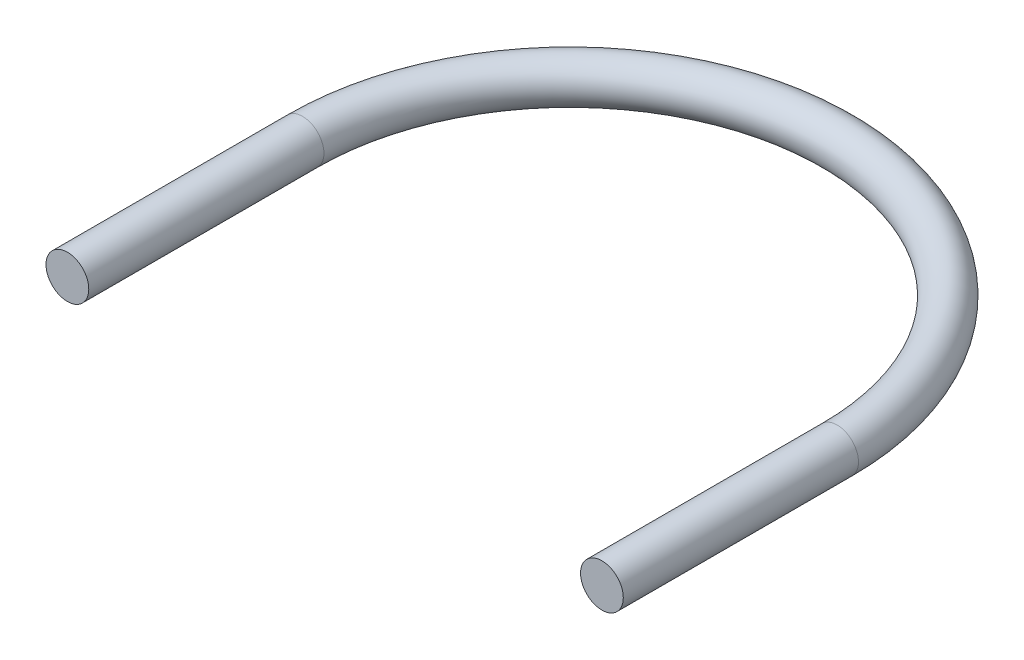
ISO-10303-21;
HEADER;
FILE_DESCRIPTION(('STEP AP214'),'2;1');
FILE_NAME('part.step','',(''),(''),'','','');
FILE_SCHEMA(('AUTOMOTIVE_DESIGN { 1 0 10303 214 1 1 1 1 }'));
ENDSEC;
DATA;
#1=APPLICATION_CONTEXT('core data for automotive mechanical design processes');
#2=APPLICATION_PROTOCOL_DEFINITION('international standard','automotive_design',2000,#1);
#3=PRODUCT_CONTEXT('',#1,'mechanical');
#4=PRODUCT('Part','Part','',(#3));
#5=PRODUCT_RELATED_PRODUCT_CATEGORY('part','',(#4));
#6=PRODUCT_DEFINITION_FORMATION('','',#4);
#7=PRODUCT_DEFINITION_CONTEXT('part definition',#1,'design');
#8=PRODUCT_DEFINITION('design','',#6,#7);
#9=PRODUCT_DEFINITION_SHAPE('','',#8);
#10=(LENGTH_UNIT() NAMED_UNIT(*) SI_UNIT(.MILLI.,.METRE.));
#11=(NAMED_UNIT(*) PLANE_ANGLE_UNIT() SI_UNIT($,.RADIAN.));
#12=(NAMED_UNIT(*) SI_UNIT($,.STERADIAN.) SOLID_ANGLE_UNIT());
#13=UNCERTAINTY_MEASURE_WITH_UNIT(LENGTH_MEASURE(1.E-05),#10,'distance_accuracy_value','');
#14=(GEOMETRIC_REPRESENTATION_CONTEXT(3) GLOBAL_UNCERTAINTY_ASSIGNED_CONTEXT((#13)) GLOBAL_UNIT_ASSIGNED_CONTEXT((#10,
#11,#12)) REPRESENTATION_CONTEXT('',''));
#15=CARTESIAN_POINT('',(0.,0.,0.));
#16=DIRECTION('',(0.,0.,1.));
#17=DIRECTION('',(1.,0.,0.));
#18=AXIS2_PLACEMENT_3D('',#15,#16,#17);
#19=CARTESIAN_POINT('',(0.,0.,31.75));
#20=DIRECTION('',(0.,-1.,0.));
#21=DIRECTION('',(0.,0.,-1.));
#22=AXIS2_PLACEMENT_3D('',#19,#20,#21);
#23=TOROIDAL_SURFACE('',#22,31.75,2.54);
#24=CARTESIAN_POINT('',(-31.75,0.,31.7500000000001));
#25=DIRECTION('',(0.,0.,-1.));
#26=DIRECTION('',(-1.,0.,0.));
#27=AXIS2_PLACEMENT_3D('',#24,#25,#26);
#28=CIRCLE('',#27,2.54);
#29=CARTESIAN_POINT('',(-34.29,0.,31.7500000000001));
#30=VERTEX_POINT('',#29);
#31=EDGE_CURVE('E10',#30,#30,#28,.T.);
#32=CARTESIAN_POINT('',(31.75,0.,31.7500000000001));
#33=DIRECTION('',(0.,0.,1.));
#34=DIRECTION('',(1.,0.,0.));
#35=AXIS2_PLACEMENT_3D('',#32,#33,#34);
#36=CIRCLE('',#35,2.54);
#37=CARTESIAN_POINT('',(34.29,0.,31.7500000000001));
#38=VERTEX_POINT('',#37);
#39=EDGE_CURVE('E39',#38,#38,#36,.T.);
#40=CARTESIAN_POINT('',(0.,0.,31.75));
#41=DIRECTION('',(0.,-1.,0.));
#42=DIRECTION('',(0.,0.,-1.));
#43=AXIS2_PLACEMENT_3D('',#40,#41,#42);
#44=CIRCLE('',#43,34.29);
#45=EDGE_CURVE('',#30,#38,#44,.T.);
#46=ORIENTED_EDGE('',*,*,#31,.T.);
#47=ORIENTED_EDGE('',*,*,#39,.F.);
#48=ORIENTED_EDGE('',*,*,#45,.T.);
#49=ORIENTED_EDGE('',*,*,#45,.F.);
#50=EDGE_LOOP('',(#46,#48,#47,#49));
#51=FACE_BOUND('',#50,.T.);
#52=ADVANCED_FACE('F33',(#51),#23,.T.);
#53=CARTESIAN_POINT('',(-31.75,0.,59.69));
#54=DIRECTION('',(0.,0.,-1.));
#55=DIRECTION('',(-1.,0.,0.));
#56=AXIS2_PLACEMENT_3D('',#53,#54,#55);
#57=CYLINDRICAL_SURFACE('',#56,2.54);
#58=CARTESIAN_POINT('',(-31.75,0.,59.69));
#59=DIRECTION('',(0.,0.,1.));
#60=DIRECTION('',(1.,0.,0.));
#61=AXIS2_PLACEMENT_3D('',#58,#59,#60);
#62=CIRCLE('',#61,2.54);
#63=CARTESIAN_POINT('',(-29.21,0.,59.69));
#64=VERTEX_POINT('',#63);
#65=EDGE_CURVE('E43',#64,#64,#62,.T.);
#66=ORIENTED_EDGE('',*,*,#65,.F.);
#67=EDGE_LOOP('',(#66));
#68=FACE_BOUND('',#67,.T.);
#69=ORIENTED_EDGE('',*,*,#31,.F.);
#70=EDGE_LOOP('',(#69));
#71=FACE_BOUND('',#70,.T.);
#72=ADVANCED_FACE('F64',(#68,#71),#57,.T.);
#73=CARTESIAN_POINT('',(-31.75,0.,59.69));
#74=DIRECTION('',(0.,0.,1.));
#75=DIRECTION('',(1.,0.,0.));
#76=AXIS2_PLACEMENT_3D('',#73,#74,#75);
#77=PLANE('',#76);
#78=ORIENTED_EDGE('',*,*,#65,.T.);
#79=EDGE_LOOP('',(#78));
#80=FACE_BOUND('',#79,.T.);
#81=ADVANCED_FACE('F57',(#80),#77,.T.);
#82=CARTESIAN_POINT('',(31.75,0.,59.69));
#83=DIRECTION('',(0.,0.,-1.));
#84=DIRECTION('',(-1.,0.,0.));
#85=AXIS2_PLACEMENT_3D('',#82,#83,#84);
#86=CYLINDRICAL_SURFACE('',#85,2.54);
#87=CARTESIAN_POINT('',(31.75,0.,59.69));
#88=DIRECTION('',(0.,0.,1.));
#89=DIRECTION('',(1.,0.,0.));
#90=AXIS2_PLACEMENT_3D('',#87,#88,#89);
#91=CIRCLE('',#90,2.54);
#92=CARTESIAN_POINT('',(34.29,0.,59.69));
#93=VERTEX_POINT('',#92);
#94=EDGE_CURVE('E47',#93,#93,#91,.T.);
#95=ORIENTED_EDGE('',*,*,#94,.F.);
#96=EDGE_LOOP('',(#95));
#97=FACE_BOUND('',#96,.T.);
#98=ORIENTED_EDGE('',*,*,#39,.T.);
#99=EDGE_LOOP('',(#98));
#100=FACE_BOUND('',#99,.T.);
#101=ADVANCED_FACE('F55',(#97,#100),#86,.T.);
#102=CARTESIAN_POINT('',(31.75,0.,59.69));
#103=DIRECTION('',(0.,0.,1.));
#104=DIRECTION('',(1.,0.,0.));
#105=AXIS2_PLACEMENT_3D('',#102,#103,#104);
#106=PLANE('',#105);
#107=ORIENTED_EDGE('',*,*,#94,.T.);
#108=EDGE_LOOP('',(#107));
#109=FACE_BOUND('',#108,.T.);
#110=ADVANCED_FACE('F53',(#109),#106,.T.);
#111=CLOSED_SHELL('',(#52,#72,#81,#101,#110));
#112=MANIFOLD_SOLID_BREP('B2',#111);
#113=ADVANCED_BREP_SHAPE_REPRESENTATION('',(#18,#112),#14);
#114=SHAPE_DEFINITION_REPRESENTATION(#9,#113);
ENDSEC;
END-ISO-10303-21;
